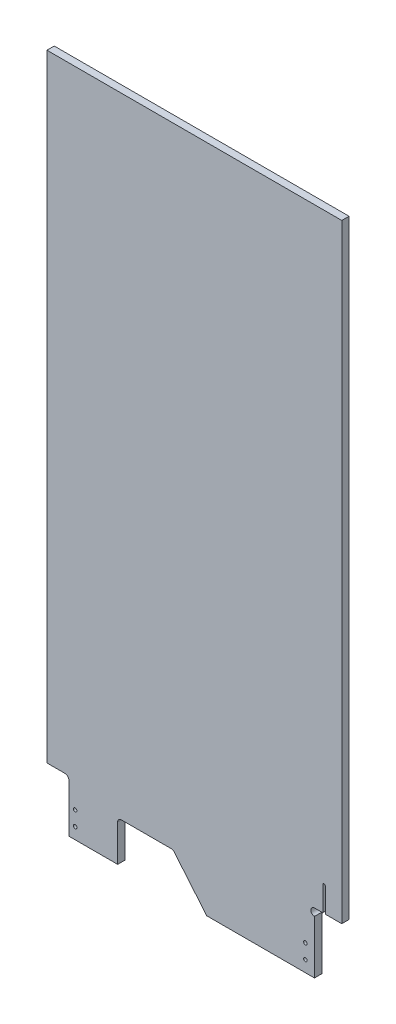
ISO-10303-21;
HEADER;
FILE_DESCRIPTION(('STEP AP214'),'2;1');
FILE_NAME('part.step','',(''),(''),'','','');
FILE_SCHEMA(('AUTOMOTIVE_DESIGN { 1 0 10303 214 1 1 1 1 }'));
ENDSEC;
DATA;
#1=APPLICATION_CONTEXT('core data for automotive mechanical design processes');
#2=APPLICATION_PROTOCOL_DEFINITION('international standard','automotive_design',2000,#1);
#3=PRODUCT_CONTEXT('',#1,'mechanical');
#4=PRODUCT('Part','Part','',(#3));
#5=PRODUCT_RELATED_PRODUCT_CATEGORY('part','',(#4));
#6=PRODUCT_DEFINITION_FORMATION('','',#4);
#7=PRODUCT_DEFINITION_CONTEXT('part definition',#1,'design');
#8=PRODUCT_DEFINITION('design','',#6,#7);
#9=PRODUCT_DEFINITION_SHAPE('','',#8);
#10=(LENGTH_UNIT() NAMED_UNIT(*) SI_UNIT(.MILLI.,.METRE.));
#11=(NAMED_UNIT(*) PLANE_ANGLE_UNIT() SI_UNIT($,.RADIAN.));
#12=(NAMED_UNIT(*) SI_UNIT($,.STERADIAN.) SOLID_ANGLE_UNIT());
#13=UNCERTAINTY_MEASURE_WITH_UNIT(LENGTH_MEASURE(1.E-05),#10,'distance_accuracy_value','');
#14=(GEOMETRIC_REPRESENTATION_CONTEXT(3) GLOBAL_UNCERTAINTY_ASSIGNED_CONTEXT((#13)) GLOBAL_UNIT_ASSIGNED_CONTEXT((#10,
#11,#12)) REPRESENTATION_CONTEXT('',''));
#15=CARTESIAN_POINT('',(0.,0.,0.));
#16=DIRECTION('',(0.,0.,1.));
#17=DIRECTION('',(1.,0.,0.));
#18=AXIS2_PLACEMENT_3D('',#15,#16,#17);
#19=CARTESIAN_POINT('',(10461.2027820586,13017.5001101928,-12.7));
#20=DIRECTION('',(0.,-1.,0.));
#21=DIRECTION('',(0.,0.,-1.));
#22=AXIS2_PLACEMENT_3D('',#19,#20,#21);
#23=PLANE('',#22);
#24=DIRECTION('',(1.,0.,0.));
#25=VECTOR('',#24,1.);
#26=CARTESIAN_POINT('',(10461.2027820586,13017.5001101928,0.));
#27=LINE('',#26,#25);
#28=CARTESIAN_POINT('',(10375.9021420887,13017.5001101928,0.));
#29=VERTEX_POINT('',#28);
#30=CARTESIAN_POINT('',(10461.2027820586,13017.5001101928,0.));
#31=VERTEX_POINT('',#30);
#32=EDGE_CURVE('E200',#29,#31,#27,.T.);
#33=ORIENTED_EDGE('',*,*,#32,.F.);
#34=DIRECTION('',(0.,0.,1.));
#35=VECTOR('',#34,1.);
#36=CARTESIAN_POINT('',(10375.9021420887,13017.5001101928,-12.7));
#37=LINE('',#36,#35);
#38=CARTESIAN_POINT('',(10375.9021420887,13017.5001101928,-12.7));
#39=VERTEX_POINT('',#38);
#40=EDGE_CURVE('E11',#39,#29,#37,.T.);
#41=ORIENTED_EDGE('',*,*,#40,.F.);
#42=DIRECTION('',(1.,0.,0.));
#43=VECTOR('',#42,1.);
#44=CARTESIAN_POINT('',(10461.2027820586,13017.5001101928,-12.7));
#45=LINE('',#44,#43);
#46=CARTESIAN_POINT('',(10461.2027820586,13017.5001101928,-12.7));
#47=VERTEX_POINT('',#46);
#48=EDGE_CURVE('E257',#39,#47,#45,.T.);
#49=ORIENTED_EDGE('',*,*,#48,.T.);
#50=DIRECTION('',(0.,0.,1.));
#51=VECTOR('',#50,1.);
#52=CARTESIAN_POINT('',(10461.2027820586,13017.5001101928,-12.7));
#53=LINE('',#52,#51);
#54=EDGE_CURVE('E34',#47,#31,#53,.T.);
#55=ORIENTED_EDGE('',*,*,#54,.T.);
#56=EDGE_LOOP('',(#33,#41,#49,#55));
#57=FACE_BOUND('',#56,.T.);
#58=ADVANCED_FACE('F31',(#57),#23,.T.);
#59=CARTESIAN_POINT('',(10375.9021420887,13017.5001101928,-12.7));
#60=DIRECTION('',(-1.,0.,0.));
#61=DIRECTION('',(0.,0.,1.));
#62=AXIS2_PLACEMENT_3D('',#59,#60,#61);
#63=PLANE('',#62);
#64=DIRECTION('',(0.,-1.,0.));
#65=VECTOR('',#64,1.);
#66=CARTESIAN_POINT('',(10375.9021420887,13017.5001101928,0.));
#67=LINE('',#66,#65);
#68=CARTESIAN_POINT('',(10375.9021420887,13102.653009206,0.));
#69=VERTEX_POINT('',#68);
#70=EDGE_CURVE('E255',#69,#29,#67,.T.);
#71=ORIENTED_EDGE('',*,*,#70,.F.);
#72=DIRECTION('',(0.,0.,1.));
#73=VECTOR('',#72,1.);
#74=CARTESIAN_POINT('',(10375.9021420887,13102.653009206,-12.7));
#75=LINE('',#74,#73);
#76=CARTESIAN_POINT('',(10375.9021420887,13102.653009206,-12.7));
#77=VERTEX_POINT('',#76);
#78=EDGE_CURVE('E40',#77,#69,#75,.T.);
#79=ORIENTED_EDGE('',*,*,#78,.F.);
#80=DIRECTION('',(0.,-1.,0.));
#81=VECTOR('',#80,1.);
#82=CARTESIAN_POINT('',(10375.9021420887,13017.5001101928,-12.7));
#83=LINE('',#82,#81);
#84=EDGE_CURVE('E190',#77,#39,#83,.T.);
#85=ORIENTED_EDGE('',*,*,#84,.T.);
#86=ORIENTED_EDGE('',*,*,#40,.T.);
#87=EDGE_LOOP('',(#71,#79,#85,#86));
#88=FACE_BOUND('',#87,.T.);
#89=ADVANCED_FACE('F293',(#88),#63,.T.);
#90=CARTESIAN_POINT('',(10369.5521420887,13102.653009206,-12.7));
#91=DIRECTION('',(0.,0.,1.));
#92=DIRECTION('',(1.,0.,0.));
#93=AXIS2_PLACEMENT_3D('',#90,#91,#92);
#94=CYLINDRICAL_SURFACE('',#93,6.34999999999941);
#95=CARTESIAN_POINT('',(10369.5521420887,13102.653009206,0.));
#96=DIRECTION('',(0.,0.,-1.));
#97=DIRECTION('',(1.,0.,0.));
#98=AXIS2_PLACEMENT_3D('',#95,#96,#97);
#99=CIRCLE('',#98,6.34999999999941);
#100=CARTESIAN_POINT('',(10369.5521420887,13109.003009206,0.));
#101=VERTEX_POINT('',#100);
#102=EDGE_CURVE('E177',#101,#69,#99,.T.);
#103=ORIENTED_EDGE('',*,*,#102,.F.);
#104=DIRECTION('',(0.,0.,1.));
#105=VECTOR('',#104,1.);
#106=CARTESIAN_POINT('',(10369.5521420887,13109.003009206,-12.7));
#107=LINE('',#106,#105);
#108=CARTESIAN_POINT('',(10369.5521420887,13109.003009206,-12.7));
#109=VERTEX_POINT('',#108);
#110=EDGE_CURVE('E172',#109,#101,#107,.T.);
#111=ORIENTED_EDGE('',*,*,#110,.F.);
#112=CARTESIAN_POINT('',(10369.5521420887,13102.653009206,-12.7));
#113=DIRECTION('',(0.,0.,-1.));
#114=DIRECTION('',(1.,0.,0.));
#115=AXIS2_PLACEMENT_3D('',#112,#113,#114);
#116=CIRCLE('',#115,6.34999999999941);
#117=EDGE_CURVE('E175',#109,#77,#116,.T.);
#118=ORIENTED_EDGE('',*,*,#117,.T.);
#119=ORIENTED_EDGE('',*,*,#78,.T.);
#120=EDGE_LOOP('',(#103,#111,#118,#119));
#121=FACE_BOUND('',#120,.T.);
#122=ADVANCED_FACE('F174',(#121),#94,.F.);
#123=CARTESIAN_POINT('',(10369.5521420887,13109.003009206,-12.7));
#124=DIRECTION('',(0.,-1.,0.));
#125=DIRECTION('',(0.,0.,-1.));
#126=AXIS2_PLACEMENT_3D('',#123,#124,#125);
#127=PLANE('',#126);
#128=DIRECTION('',(1.,0.,0.));
#129=VECTOR('',#128,1.);
#130=CARTESIAN_POINT('',(10369.5521420887,13109.003009206,0.));
#131=LINE('',#130,#129);
#132=CARTESIAN_POINT('',(10337.8021420887,13109.003009206,0.));
#133=VERTEX_POINT('',#132);
#134=EDGE_CURVE('E252',#133,#101,#131,.T.);
#135=ORIENTED_EDGE('',*,*,#134,.F.);
#136=DIRECTION('',(0.,0.,1.));
#137=VECTOR('',#136,1.);
#138=CARTESIAN_POINT('',(10337.8021420887,13109.003009206,-12.7));
#139=LINE('',#138,#137);
#140=CARTESIAN_POINT('',(10337.8021420887,13109.003009206,-12.7));
#141=VERTEX_POINT('',#140);
#142=EDGE_CURVE('E182',#141,#133,#139,.T.);
#143=ORIENTED_EDGE('',*,*,#142,.F.);
#144=DIRECTION('',(1.,0.,0.));
#145=VECTOR('',#144,1.);
#146=CARTESIAN_POINT('',(10369.5521420887,13109.003009206,-12.7));
#147=LINE('',#146,#145);
#148=EDGE_CURVE('E188',#141,#109,#147,.T.);
#149=ORIENTED_EDGE('',*,*,#148,.T.);
#150=ORIENTED_EDGE('',*,*,#110,.T.);
#151=EDGE_LOOP('',(#135,#143,#149,#150));
#152=FACE_BOUND('',#151,.T.);
#153=ADVANCED_FACE('F192',(#152),#127,.T.);
#154=CARTESIAN_POINT('',(10337.8021420887,13109.003009206,-12.7));
#155=DIRECTION('',(-0.999999999999162,-1.29471476797222E-06,0.));
#156=DIRECTION('',(1.29471476797222E-06,-0.999999999999162,0.));
#157=AXIS2_PLACEMENT_3D('',#154,#155,#156);
#158=PLANE('',#157);
#159=DIRECTION('',(1.29471476797222E-06,-0.999999999999162,0.));
#160=VECTOR('',#159,1.);
#161=CARTESIAN_POINT('',(10337.8021420887,13109.003009206,0.));
#162=LINE('',#161,#160);
#163=CARTESIAN_POINT('',(10337.8007478141,14185.9001101928,0.));
#164=VERTEX_POINT('',#163);
#165=EDGE_CURVE('E249',#164,#133,#162,.T.);
#166=ORIENTED_EDGE('',*,*,#165,.F.);
#167=DIRECTION('',(0.,0.,1.));
#168=VECTOR('',#167,1.);
#169=CARTESIAN_POINT('',(10337.8007478141,14185.9001101928,-12.7));
#170=LINE('',#169,#168);
#171=CARTESIAN_POINT('',(10337.8007478141,14185.9001101928,-12.7));
#172=VERTEX_POINT('',#171);
#173=EDGE_CURVE('E261',#172,#164,#170,.T.);
#174=ORIENTED_EDGE('',*,*,#173,.F.);
#175=DIRECTION('',(1.29471476797222E-06,-0.999999999999162,0.));
#176=VECTOR('',#175,1.);
#177=CARTESIAN_POINT('',(10337.8021420887,13109.003009206,-12.7));
#178=LINE('',#177,#176);
#179=EDGE_CURVE('E193',#172,#141,#178,.T.);
#180=ORIENTED_EDGE('',*,*,#179,.T.);
#181=ORIENTED_EDGE('',*,*,#142,.T.);
#182=EDGE_LOOP('',(#166,#174,#180,#181));
#183=FACE_BOUND('',#182,.T.);
#184=ADVANCED_FACE('F306',(#183),#158,.T.);
#185=CARTESIAN_POINT('',(10337.8007478141,14185.9001101928,-12.7));
#186=DIRECTION('',(0.,1.,0.));
#187=DIRECTION('',(0.,0.,1.));
#188=AXIS2_PLACEMENT_3D('',#185,#186,#187);
#189=PLANE('',#188);
#190=DIRECTION('',(-1.,0.,0.));
#191=VECTOR('',#190,1.);
#192=CARTESIAN_POINT('',(10337.8007478141,14185.9001101928,0.));
#193=LINE('',#192,#191);
#194=CARTESIAN_POINT('',(10852.1479242815,14185.9001101928,0.));
#195=VERTEX_POINT('',#194);
#196=EDGE_CURVE('E246',#195,#164,#193,.T.);
#197=ORIENTED_EDGE('',*,*,#196,.F.);
#198=DIRECTION('',(0.,0.,1.));
#199=VECTOR('',#198,1.);
#200=CARTESIAN_POINT('',(10852.1479242815,14185.9001101928,-12.7));
#201=LINE('',#200,#199);
#202=CARTESIAN_POINT('',(10852.1479242815,14185.9001101928,-12.7));
#203=VERTEX_POINT('',#202);
#204=EDGE_CURVE('E263',#203,#195,#201,.T.);
#205=ORIENTED_EDGE('',*,*,#204,.F.);
#206=DIRECTION('',(-1.,0.,0.));
#207=VECTOR('',#206,1.);
#208=CARTESIAN_POINT('',(10337.8007478141,14185.9001101928,-12.7));
#209=LINE('',#208,#207);
#210=EDGE_CURVE('E195',#203,#172,#209,.T.);
#211=ORIENTED_EDGE('',*,*,#210,.T.);
#212=ORIENTED_EDGE('',*,*,#173,.T.);
#213=EDGE_LOOP('',(#197,#205,#211,#212));
#214=FACE_BOUND('',#213,.T.);
#215=ADVANCED_FACE('F309',(#214),#189,.T.);
#216=CARTESIAN_POINT('',(10852.1479242815,14185.9001101928,-12.7));
#217=DIRECTION('',(0.99999999999647,2.65716833036978E-06,0.));
#218=DIRECTION('',(-2.65716833036978E-06,0.99999999999647,0.));
#219=AXIS2_PLACEMENT_3D('',#216,#217,#218);
#220=PLANE('',#219);
#221=DIRECTION('',(-2.65716833036978E-06,0.99999999999647,0.));
#222=VECTOR('',#221,1.);
#223=CARTESIAN_POINT('',(10852.1479242815,14185.9001101928,0.));
#224=LINE('',#223,#222);
#225=CARTESIAN_POINT('',(10852.1507478141,13123.290509206,0.));
#226=VERTEX_POINT('',#225);
#227=EDGE_CURVE('E243',#226,#195,#224,.T.);
#228=ORIENTED_EDGE('',*,*,#227,.F.);
#229=DIRECTION('',(0.,0.,1.));
#230=VECTOR('',#229,1.);
#231=CARTESIAN_POINT('',(10852.1507478141,13123.290509206,-12.7));
#232=LINE('',#231,#230);
#233=CARTESIAN_POINT('',(10852.1507478141,13123.290509206,-12.7));
#234=VERTEX_POINT('',#233);
#235=EDGE_CURVE('E265',#234,#226,#232,.T.);
#236=ORIENTED_EDGE('',*,*,#235,.F.);
#237=DIRECTION('',(-2.65716833036978E-06,0.99999999999647,0.));
#238=VECTOR('',#237,1.);
#239=CARTESIAN_POINT('',(10852.1479242815,14185.9001101928,-12.7));
#240=LINE('',#239,#238);
#241=EDGE_CURVE('E459',#234,#203,#240,.T.);
#242=ORIENTED_EDGE('',*,*,#241,.T.);
#243=ORIENTED_EDGE('',*,*,#204,.T.);
#244=EDGE_LOOP('',(#228,#236,#242,#243));
#245=FACE_BOUND('',#244,.T.);
#246=ADVANCED_FACE('F313',(#245),#220,.T.);
#247=CARTESIAN_POINT('',(10852.1507478141,13123.290509206,-12.7));
#248=DIRECTION('',(0.,-1.,0.));
#249=DIRECTION('',(0.,0.,-1.));
#250=AXIS2_PLACEMENT_3D('',#247,#248,#249);
#251=PLANE('',#250);
#252=DIRECTION('',(1.,0.,0.));
#253=VECTOR('',#252,1.);
#254=CARTESIAN_POINT('',(10852.1507478141,13123.290509206,0.));
#255=LINE('',#254,#253);
#256=CARTESIAN_POINT('',(10823.5812364163,13123.290509206,0.));
#257=VERTEX_POINT('',#256);
#258=EDGE_CURVE('E240',#257,#226,#255,.T.);
#259=ORIENTED_EDGE('',*,*,#258,.F.);
#260=DIRECTION('',(0.,0.,1.));
#261=VECTOR('',#260,1.);
#262=CARTESIAN_POINT('',(10823.5812364163,13123.290509206,-12.7));
#263=LINE('',#262,#261);
#264=CARTESIAN_POINT('',(10823.5812364163,13123.290509206,-12.7));
#265=VERTEX_POINT('',#264);
#266=EDGE_CURVE('E267',#265,#257,#263,.T.);
#267=ORIENTED_EDGE('',*,*,#266,.F.);
#268=DIRECTION('',(1.,0.,0.));
#269=VECTOR('',#268,1.);
#270=CARTESIAN_POINT('',(10852.1507478141,13123.290509206,-12.7));
#271=LINE('',#270,#269);
#272=EDGE_CURVE('E456',#265,#234,#271,.T.);
#273=ORIENTED_EDGE('',*,*,#272,.T.);
#274=ORIENTED_EDGE('',*,*,#235,.T.);
#275=EDGE_LOOP('',(#259,#267,#273,#274));
#276=FACE_BOUND('',#275,.T.);
#277=ADVANCED_FACE('F317',(#276),#251,.T.);
#278=CARTESIAN_POINT('',(10823.5812364163,13123.290509206,-12.7));
#279=DIRECTION('',(-1.,0.,0.));
#280=DIRECTION('',(0.,0.,1.));
#281=AXIS2_PLACEMENT_3D('',#278,#279,#280);
#282=PLANE('',#281);
#283=DIRECTION('',(0.,-1.,0.));
#284=VECTOR('',#283,1.);
#285=CARTESIAN_POINT('',(10823.5812364163,13123.290509206,0.));
#286=LINE('',#285,#284);
#287=CARTESIAN_POINT('',(10823.5812364163,13165.835509206,0.));
#288=VERTEX_POINT('',#287);
#289=EDGE_CURVE('E237',#288,#257,#286,.T.);
#290=ORIENTED_EDGE('',*,*,#289,.F.);
#291=DIRECTION('',(0.,0.,1.));
#292=VECTOR('',#291,1.);
#293=CARTESIAN_POINT('',(10823.5812364163,13165.835509206,-12.7));
#294=LINE('',#293,#292);
#295=CARTESIAN_POINT('',(10823.5812364163,13165.835509206,-12.7));
#296=VERTEX_POINT('',#295);
#297=EDGE_CURVE('E269',#296,#288,#294,.T.);
#298=ORIENTED_EDGE('',*,*,#297,.F.);
#299=DIRECTION('',(0.,-1.,0.));
#300=VECTOR('',#299,1.);
#301=CARTESIAN_POINT('',(10823.5812364163,13123.290509206,-12.7));
#302=LINE('',#301,#300);
#303=EDGE_CURVE('E453',#296,#265,#302,.T.);
#304=ORIENTED_EDGE('',*,*,#303,.T.);
#305=ORIENTED_EDGE('',*,*,#266,.T.);
#306=EDGE_LOOP('',(#290,#298,#304,#305));
#307=FACE_BOUND('',#306,.T.);
#308=ADVANCED_FACE('F321',(#307),#282,.T.);
#309=CARTESIAN_POINT('',(10821.2952364163,13165.835509206,-12.7));
#310=DIRECTION('',(0.,0.,1.));
#311=DIRECTION('',(1.,0.,0.));
#312=AXIS2_PLACEMENT_3D('',#309,#310,#311);
#313=CYLINDRICAL_SURFACE('',#312,2.28599999999979);
#314=CARTESIAN_POINT('',(10821.2952364163,13165.835509206,0.));
#315=DIRECTION('',(0.,0.,-1.));
#316=DIRECTION('',(1.,0.,0.));
#317=AXIS2_PLACEMENT_3D('',#314,#315,#316);
#318=CIRCLE('',#317,2.28599999999979);
#319=CARTESIAN_POINT('',(10819.0092364163,13165.835509206,0.));
#320=VERTEX_POINT('',#319);
#321=EDGE_CURVE('E234',#320,#288,#318,.T.);
#322=ORIENTED_EDGE('',*,*,#321,.F.);
#323=DIRECTION('',(0.,0.,1.));
#324=VECTOR('',#323,1.);
#325=CARTESIAN_POINT('',(10819.0092364163,13165.835509206,-12.7));
#326=LINE('',#325,#324);
#327=CARTESIAN_POINT('',(10819.0092364163,13165.835509206,-12.7));
#328=VERTEX_POINT('',#327);
#329=EDGE_CURVE('E271',#328,#320,#326,.T.);
#330=ORIENTED_EDGE('',*,*,#329,.F.);
#331=CARTESIAN_POINT('',(10821.2952364163,13165.835509206,-12.7));
#332=DIRECTION('',(0.,0.,-1.));
#333=DIRECTION('',(1.,0.,0.));
#334=AXIS2_PLACEMENT_3D('',#331,#332,#333);
#335=CIRCLE('',#334,2.28599999999979);
#336=EDGE_CURVE('E450',#328,#296,#335,.T.);
#337=ORIENTED_EDGE('',*,*,#336,.T.);
#338=ORIENTED_EDGE('',*,*,#297,.T.);
#339=EDGE_LOOP('',(#322,#330,#337,#338));
#340=FACE_BOUND('',#339,.T.);
#341=ADVANCED_FACE('F325',(#340),#313,.F.);
#342=CARTESIAN_POINT('',(10819.0092364163,13165.835509206,-12.7));
#343=DIRECTION('',(1.,0.,0.));
#344=DIRECTION('',(0.,0.,-1.));
#345=AXIS2_PLACEMENT_3D('',#342,#343,#344);
#346=PLANE('',#345);
#347=DIRECTION('',(0.,1.,0.));
#348=VECTOR('',#347,1.);
#349=CARTESIAN_POINT('',(10819.0092364163,13165.835509206,0.));
#350=LINE('',#349,#348);
#351=CARTESIAN_POINT('',(10819.0092364163,13123.290509206,0.));
#352=VERTEX_POINT('',#351);
#353=EDGE_CURVE('E231',#352,#320,#350,.T.);
#354=ORIENTED_EDGE('',*,*,#353,.F.);
#355=DIRECTION('',(0.,0.,1.));
#356=VECTOR('',#355,1.);
#357=CARTESIAN_POINT('',(10819.0092364163,13123.290509206,-12.7));
#358=LINE('',#357,#356);
#359=CARTESIAN_POINT('',(10819.0092364163,13123.290509206,-12.7));
#360=VERTEX_POINT('',#359);
#361=EDGE_CURVE('E273',#360,#352,#358,.T.);
#362=ORIENTED_EDGE('',*,*,#361,.F.);
#363=DIRECTION('',(0.,1.,0.));
#364=VECTOR('',#363,1.);
#365=CARTESIAN_POINT('',(10819.0092364163,13165.835509206,-12.7));
#366=LINE('',#365,#364);
#367=EDGE_CURVE('E447',#360,#328,#366,.T.);
#368=ORIENTED_EDGE('',*,*,#367,.T.);
#369=ORIENTED_EDGE('',*,*,#329,.T.);
#370=EDGE_LOOP('',(#354,#362,#368,#369));
#371=FACE_BOUND('',#370,.T.);
#372=ADVANCED_FACE('F329',(#371),#346,.T.);
#373=CARTESIAN_POINT('',(10819.0092364163,13123.290509206,-12.7));
#374=DIRECTION('',(0.,-1.,0.));
#375=DIRECTION('',(0.,0.,-1.));
#376=AXIS2_PLACEMENT_3D('',#373,#374,#375);
#377=PLANE('',#376);
#378=DIRECTION('',(1.,0.,0.));
#379=VECTOR('',#378,1.);
#380=CARTESIAN_POINT('',(10819.0092364163,13123.290509206,0.));
#381=LINE('',#380,#379);
#382=CARTESIAN_POINT('',(10804.5257478141,13123.290509206,0.));
#383=VERTEX_POINT('',#382);
#384=EDGE_CURVE('E228',#383,#352,#381,.T.);
#385=ORIENTED_EDGE('',*,*,#384,.F.);
#386=DIRECTION('',(0.,0.,1.));
#387=VECTOR('',#386,1.);
#388=CARTESIAN_POINT('',(10804.5257478141,13123.290509206,-12.7));
#389=LINE('',#388,#387);
#390=CARTESIAN_POINT('',(10804.5257478141,13123.290509206,-12.7));
#391=VERTEX_POINT('',#390);
#392=EDGE_CURVE('E275',#391,#383,#389,.T.);
#393=ORIENTED_EDGE('',*,*,#392,.F.);
#394=DIRECTION('',(1.,0.,0.));
#395=VECTOR('',#394,1.);
#396=CARTESIAN_POINT('',(10819.0092364163,13123.290509206,-12.7));
#397=LINE('',#396,#395);
#398=EDGE_CURVE('E444',#391,#360,#397,.T.);
#399=ORIENTED_EDGE('',*,*,#398,.T.);
#400=ORIENTED_EDGE('',*,*,#361,.T.);
#401=EDGE_LOOP('',(#385,#393,#399,#400));
#402=FACE_BOUND('',#401,.T.);
#403=ADVANCED_FACE('F333',(#402),#377,.T.);
#404=CARTESIAN_POINT('',(10804.5257478141,13116.940509206,-12.7));
#405=DIRECTION('',(0.,0.,1.));
#406=DIRECTION('',(1.,0.,0.));
#407=AXIS2_PLACEMENT_3D('',#404,#405,#406);
#408=CYLINDRICAL_SURFACE('',#407,6.34999999999941);
#409=CARTESIAN_POINT('',(10804.5257478141,13116.940509206,0.));
#410=DIRECTION('',(0.,0.,-1.));
#411=DIRECTION('',(1.,0.,0.));
#412=AXIS2_PLACEMENT_3D('',#409,#410,#411);
#413=CIRCLE('',#412,6.34999999999941);
#414=CARTESIAN_POINT('',(10804.5257478141,13110.590509206,0.));
#415=VERTEX_POINT('',#414);
#416=EDGE_CURVE('E225',#415,#383,#413,.T.);
#417=ORIENTED_EDGE('',*,*,#416,.F.);
#418=DIRECTION('',(0.,0.,1.));
#419=VECTOR('',#418,1.);
#420=CARTESIAN_POINT('',(10804.5257478141,13110.590509206,-12.7));
#421=LINE('',#420,#419);
#422=CARTESIAN_POINT('',(10804.5257478141,13110.590509206,-12.7));
#423=VERTEX_POINT('',#422);
#424=EDGE_CURVE('E277',#423,#415,#421,.T.);
#425=ORIENTED_EDGE('',*,*,#424,.F.);
#426=CARTESIAN_POINT('',(10804.5257478141,13116.940509206,-12.7));
#427=DIRECTION('',(0.,0.,-1.));
#428=DIRECTION('',(1.,0.,0.));
#429=AXIS2_PLACEMENT_3D('',#426,#427,#428);
#430=CIRCLE('',#429,6.34999999999941);
#431=EDGE_CURVE('E441',#423,#391,#430,.T.);
#432=ORIENTED_EDGE('',*,*,#431,.T.);
#433=ORIENTED_EDGE('',*,*,#392,.T.);
#434=EDGE_LOOP('',(#417,#425,#432,#433));
#435=FACE_BOUND('',#434,.T.);
#436=ADVANCED_FACE('F337',(#435),#408,.F.);
#437=CARTESIAN_POINT('',(10804.5257478141,13110.590509206,-12.7));
#438=DIRECTION('',(1.,0.,0.));
#439=DIRECTION('',(0.,0.,-1.));
#440=AXIS2_PLACEMENT_3D('',#437,#438,#439);
#441=PLANE('',#440);
#442=DIRECTION('',(0.,1.,0.));
#443=VECTOR('',#442,1.);
#444=CARTESIAN_POINT('',(10804.5257478141,13110.590509206,0.));
#445=LINE('',#444,#443);
#446=CARTESIAN_POINT('',(10804.5257478141,13017.5001101928,0.));
#447=VERTEX_POINT('',#446);
#448=EDGE_CURVE('E222',#447,#415,#445,.T.);
#449=ORIENTED_EDGE('',*,*,#448,.F.);
#450=DIRECTION('',(0.,0.,1.));
#451=VECTOR('',#450,1.);
#452=CARTESIAN_POINT('',(10804.5257478141,13017.5001101928,-12.7));
#453=LINE('',#452,#451);
#454=CARTESIAN_POINT('',(10804.5257478141,13017.5001101928,-12.7));
#455=VERTEX_POINT('',#454);
#456=EDGE_CURVE('E279',#455,#447,#453,.T.);
#457=ORIENTED_EDGE('',*,*,#456,.F.);
#458=DIRECTION('',(0.,1.,0.));
#459=VECTOR('',#458,1.);
#460=CARTESIAN_POINT('',(10804.5257478141,13110.590509206,-12.7));
#461=LINE('',#460,#459);
#462=EDGE_CURVE('E438',#455,#423,#461,.T.);
#463=ORIENTED_EDGE('',*,*,#462,.T.);
#464=ORIENTED_EDGE('',*,*,#424,.T.);
#465=EDGE_LOOP('',(#449,#457,#463,#464));
#466=FACE_BOUND('',#465,.T.);
#467=ADVANCED_FACE('F341',(#466),#441,.T.);
#468=CARTESIAN_POINT('',(10804.5257478141,13017.5001101928,-12.7));
#469=DIRECTION('',(0.,-1.,0.));
#470=DIRECTION('',(0.,0.,-1.));
#471=AXIS2_PLACEMENT_3D('',#468,#469,#470);
#472=PLANE('',#471);
#473=DIRECTION('',(1.,0.,0.));
#474=VECTOR('',#473,1.);
#475=CARTESIAN_POINT('',(10804.5257478141,13017.5001101928,0.));
#476=LINE('',#475,#474);
#477=CARTESIAN_POINT('',(10616.6252235168,13017.5001101928,0.));
#478=VERTEX_POINT('',#477);
#479=EDGE_CURVE('E219',#478,#447,#476,.T.);
#480=ORIENTED_EDGE('',*,*,#479,.F.);
#481=DIRECTION('',(0.,0.,1.));
#482=VECTOR('',#481,1.);
#483=CARTESIAN_POINT('',(10616.6252235168,13017.5001101928,-12.7));
#484=LINE('',#483,#482);
#485=CARTESIAN_POINT('',(10616.6252235168,13017.5001101928,-12.7));
#486=VERTEX_POINT('',#485);
#487=EDGE_CURVE('E281',#486,#478,#484,.T.);
#488=ORIENTED_EDGE('',*,*,#487,.F.);
#489=DIRECTION('',(1.,0.,0.));
#490=VECTOR('',#489,1.);
#491=CARTESIAN_POINT('',(10804.5257478141,13017.5001101928,-12.7));
#492=LINE('',#491,#490);
#493=EDGE_CURVE('E435',#486,#455,#492,.T.);
#494=ORIENTED_EDGE('',*,*,#493,.T.);
#495=ORIENTED_EDGE('',*,*,#456,.T.);
#496=EDGE_LOOP('',(#480,#488,#494,#495));
#497=FACE_BOUND('',#496,.T.);
#498=ADVANCED_FACE('F345',(#497),#472,.T.);
#499=CARTESIAN_POINT('',(10616.6252235168,13017.5001101928,-12.7));
#500=DIRECTION('',(-0.767281863842619,-0.641310019739437,0.));
#501=DIRECTION('',(0.641310019739437,-0.767281863842619,0.));
#502=AXIS2_PLACEMENT_3D('',#499,#500,#501);
#503=PLANE('',#502);
#504=DIRECTION('',(0.641310019739437,-0.767281863842619,0.));
#505=VECTOR('',#504,1.);
#506=CARTESIAN_POINT('',(10616.6252235168,13017.5001101928,0.));
#507=LINE('',#506,#505);
#508=CARTESIAN_POINT('',(10559.6498937161,13085.6670433405,0.));
#509=VERTEX_POINT('',#508);
#510=EDGE_CURVE('E216',#509,#478,#507,.T.);
#511=ORIENTED_EDGE('',*,*,#510,.F.);
#512=DIRECTION('',(0.,0.,1.));
#513=VECTOR('',#512,1.);
#514=CARTESIAN_POINT('',(10559.6498937161,13085.6670433405,-12.7));
#515=LINE('',#514,#513);
#516=CARTESIAN_POINT('',(10559.6498937161,13085.6670433405,-12.7));
#517=VERTEX_POINT('',#516);
#518=EDGE_CURVE('E283',#517,#509,#515,.T.);
#519=ORIENTED_EDGE('',*,*,#518,.F.);
#520=DIRECTION('',(0.641310019739437,-0.767281863842619,0.));
#521=VECTOR('',#520,1.);
#522=CARTESIAN_POINT('',(10616.6252235168,13017.5001101928,-12.7));
#523=LINE('',#522,#521);
#524=EDGE_CURVE('E432',#517,#486,#523,.T.);
#525=ORIENTED_EDGE('',*,*,#524,.T.);
#526=ORIENTED_EDGE('',*,*,#487,.T.);
#527=EDGE_LOOP('',(#511,#519,#525,#526));
#528=FACE_BOUND('',#527,.T.);
#529=ADVANCED_FACE('F349',(#528),#503,.T.);
#530=CARTESIAN_POINT('',(10554.7776538797,13081.5947247155,-12.7));
#531=DIRECTION('',(0.,0.,1.));
#532=DIRECTION('',(1.,0.,0.));
#533=AXIS2_PLACEMENT_3D('',#530,#531,#532);
#534=CYLINDRICAL_SURFACE('',#533,6.35000000055316);
#535=CARTESIAN_POINT('',(10554.7776538797,13081.5947247155,0.));
#536=DIRECTION('',(0.,0.,-1.));
#537=DIRECTION('',(1.,0.,0.));
#538=AXIS2_PLACEMENT_3D('',#535,#536,#537);
#539=CIRCLE('',#538,6.35000000055316);
#540=CARTESIAN_POINT('',(10554.7776538797,13087.9447247161,0.));
#541=VERTEX_POINT('',#540);
#542=EDGE_CURVE('E213',#541,#509,#539,.T.);
#543=ORIENTED_EDGE('',*,*,#542,.F.);
#544=DIRECTION('',(0.,0.,1.));
#545=VECTOR('',#544,1.);
#546=CARTESIAN_POINT('',(10554.7776538797,13087.9447247161,-12.7));
#547=LINE('',#546,#545);
#548=CARTESIAN_POINT('',(10554.7776538797,13087.9447247161,-12.7));
#549=VERTEX_POINT('',#548);
#550=EDGE_CURVE('E285',#549,#541,#547,.T.);
#551=ORIENTED_EDGE('',*,*,#550,.F.);
#552=CARTESIAN_POINT('',(10554.7776538797,13081.5947247155,-12.7));
#553=DIRECTION('',(0.,0.,-1.));
#554=DIRECTION('',(1.,0.,0.));
#555=AXIS2_PLACEMENT_3D('',#552,#553,#554);
#556=CIRCLE('',#555,6.35000000055316);
#557=EDGE_CURVE('E429',#549,#517,#556,.T.);
#558=ORIENTED_EDGE('',*,*,#557,.T.);
#559=ORIENTED_EDGE('',*,*,#518,.T.);
#560=EDGE_LOOP('',(#543,#551,#558,#559));
#561=FACE_BOUND('',#560,.T.);
#562=ADVANCED_FACE('F353',(#561),#534,.F.);
#563=CARTESIAN_POINT('',(10554.7776538797,13087.9447247161,-12.7));
#564=DIRECTION('',(0.,-1.,0.));
#565=DIRECTION('',(0.,0.,-1.));
#566=AXIS2_PLACEMENT_3D('',#563,#564,#565);
#567=PLANE('',#566);
#568=DIRECTION('',(1.,0.,0.));
#569=VECTOR('',#568,1.);
#570=CARTESIAN_POINT('',(10554.7776538797,13087.9447247161,0.));
#571=LINE('',#570,#569);
#572=CARTESIAN_POINT('',(10467.5527820586,13087.9447247161,0.));
#573=VERTEX_POINT('',#572);
#574=EDGE_CURVE('E210',#573,#541,#571,.T.);
#575=ORIENTED_EDGE('',*,*,#574,.F.);
#576=DIRECTION('',(0.,0.,1.));
#577=VECTOR('',#576,1.);
#578=CARTESIAN_POINT('',(10467.5527820586,13087.9447247161,-12.7));
#579=LINE('',#578,#577);
#580=CARTESIAN_POINT('',(10467.5527820586,13087.9447247161,-12.7));
#581=VERTEX_POINT('',#580);
#582=EDGE_CURVE('E287',#581,#573,#579,.T.);
#583=ORIENTED_EDGE('',*,*,#582,.F.);
#584=DIRECTION('',(1.,0.,0.));
#585=VECTOR('',#584,1.);
#586=CARTESIAN_POINT('',(10554.7776538797,13087.9447247161,-12.7));
#587=LINE('',#586,#585);
#588=EDGE_CURVE('E426',#581,#549,#587,.T.);
#589=ORIENTED_EDGE('',*,*,#588,.T.);
#590=ORIENTED_EDGE('',*,*,#550,.T.);
#591=EDGE_LOOP('',(#575,#583,#589,#590));
#592=FACE_BOUND('',#591,.T.);
#593=ADVANCED_FACE('F357',(#592),#567,.T.);
#594=CARTESIAN_POINT('',(10467.5527820586,13081.5947247161,-12.7));
#595=DIRECTION('',(0.,0.,1.));
#596=DIRECTION('',(1.,0.,0.));
#597=AXIS2_PLACEMENT_3D('',#594,#595,#596);
#598=CYLINDRICAL_SURFACE('',#597,6.35000000000119);
#599=CARTESIAN_POINT('',(10467.5527820586,13081.5947247161,0.));
#600=DIRECTION('',(0.,0.,-1.));
#601=DIRECTION('',(1.,0.,0.));
#602=AXIS2_PLACEMENT_3D('',#599,#600,#601);
#603=CIRCLE('',#602,6.35000000000119);
#604=CARTESIAN_POINT('',(10461.2027820586,13081.5947247161,0.));
#605=VERTEX_POINT('',#604);
#606=EDGE_CURVE('E207',#605,#573,#603,.T.);
#607=ORIENTED_EDGE('',*,*,#606,.F.);
#608=DIRECTION('',(0.,0.,1.));
#609=VECTOR('',#608,1.);
#610=CARTESIAN_POINT('',(10461.2027820586,13081.5947247161,-12.7));
#611=LINE('',#610,#609);
#612=CARTESIAN_POINT('',(10461.2027820586,13081.5947247161,-12.7));
#613=VERTEX_POINT('',#612);
#614=EDGE_CURVE('E288',#613,#605,#611,.T.);
#615=ORIENTED_EDGE('',*,*,#614,.F.);
#616=CARTESIAN_POINT('',(10467.5527820586,13081.5947247161,-12.7));
#617=DIRECTION('',(0.,0.,-1.));
#618=DIRECTION('',(1.,0.,0.));
#619=AXIS2_PLACEMENT_3D('',#616,#617,#618);
#620=CIRCLE('',#619,6.35000000000119);
#621=EDGE_CURVE('E423',#613,#581,#620,.T.);
#622=ORIENTED_EDGE('',*,*,#621,.T.);
#623=ORIENTED_EDGE('',*,*,#582,.T.);
#624=EDGE_LOOP('',(#607,#615,#622,#623));
#625=FACE_BOUND('',#624,.T.);
#626=ADVANCED_FACE('F361',(#625),#598,.F.);
#627=CARTESIAN_POINT('',(10461.2027820586,13081.5947247161,-12.7));
#628=DIRECTION('',(1.,0.,0.));
#629=DIRECTION('',(0.,0.,-1.));
#630=AXIS2_PLACEMENT_3D('',#627,#628,#629);
#631=PLANE('',#630);
#632=DIRECTION('',(0.,1.,0.));
#633=VECTOR('',#632,1.);
#634=CARTESIAN_POINT('',(10461.2027820586,13081.5947247161,0.));
#635=LINE('',#634,#633);
#636=EDGE_CURVE('E203',#31,#605,#635,.T.);
#637=ORIENTED_EDGE('',*,*,#636,.F.);
#638=ORIENTED_EDGE('',*,*,#54,.F.);
#639=DIRECTION('',(0.,1.,0.));
#640=VECTOR('',#639,1.);
#641=CARTESIAN_POINT('',(10461.2027820586,13081.5947247161,-12.7));
#642=LINE('',#641,#640);
#643=EDGE_CURVE('E421',#47,#613,#642,.T.);
#644=ORIENTED_EDGE('',*,*,#643,.T.);
#645=ORIENTED_EDGE('',*,*,#614,.T.);
#646=EDGE_LOOP('',(#637,#638,#644,#645));
#647=FACE_BOUND('',#646,.T.);
#648=ADVANCED_FACE('F290',(#647),#631,.T.);
#649=CARTESIAN_POINT('',(10369.5521420887,13102.653009206,-12.7));
#650=DIRECTION('',(0.,0.,1.));
#651=DIRECTION('',(1.,0.,0.));
#652=AXIS2_PLACEMENT_3D('',#649,#650,#651);
#653=PLANE('',#652);
#654=CARTESIAN_POINT('',(10788.6500506781,13037.3121101928,-12.7));
#655=DIRECTION('',(0.,0.,1.));
#656=DIRECTION('',(1.,0.,0.));
#657=AXIS2_PLACEMENT_3D('',#654,#655,#656);
#658=CIRCLE('',#657,3.11149999999886);
#659=CARTESIAN_POINT('',(10791.7615506781,13037.3121101928,-12.7));
#660=VERTEX_POINT('',#659);
#661=EDGE_CURVE('E396',#660,#660,#658,.F.);
#662=ORIENTED_EDGE('',*,*,#661,.F.);
#663=EDGE_LOOP('',(#662));
#664=FACE_BOUND('',#663,.T.);
#665=CARTESIAN_POINT('',(10788.6500506781,13062.7121101928,-12.7));
#666=DIRECTION('',(0.,0.,1.));
#667=DIRECTION('',(1.,0.,0.));
#668=AXIS2_PLACEMENT_3D('',#665,#666,#667);
#669=CIRCLE('',#668,3.11149999999886);
#670=CARTESIAN_POINT('',(10791.7615506781,13062.7121101928,-12.7));
#671=VERTEX_POINT('',#670);
#672=EDGE_CURVE('E406',#671,#671,#669,.F.);
#673=ORIENTED_EDGE('',*,*,#672,.F.);
#674=EDGE_LOOP('',(#673));
#675=FACE_BOUND('',#674,.T.);
#676=CARTESIAN_POINT('',(10387.0125506781,13037.3121101928,-12.7));
#677=DIRECTION('',(0.,0.,1.));
#678=DIRECTION('',(1.,0.,0.));
#679=AXIS2_PLACEMENT_3D('',#676,#677,#678);
#680=CIRCLE('',#679,3.11149999999886);
#681=CARTESIAN_POINT('',(10390.1240506781,13037.3121101928,-12.7));
#682=VERTEX_POINT('',#681);
#683=EDGE_CURVE('E412',#682,#682,#680,.F.);
#684=ORIENTED_EDGE('',*,*,#683,.F.);
#685=EDGE_LOOP('',(#684));
#686=FACE_BOUND('',#685,.T.);
#687=CARTESIAN_POINT('',(10387.0125506781,13062.7121101928,-12.7));
#688=DIRECTION('',(0.,0.,1.));
#689=DIRECTION('',(1.,0.,0.));
#690=AXIS2_PLACEMENT_3D('',#687,#688,#689);
#691=CIRCLE('',#690,3.11149999999938);
#692=CARTESIAN_POINT('',(10390.1240506781,13062.7121101928,-12.7));
#693=VERTEX_POINT('',#692);
#694=EDGE_CURVE('E204',#693,#693,#691,.F.);
#695=ORIENTED_EDGE('',*,*,#694,.F.);
#696=EDGE_LOOP('',(#695));
#697=FACE_BOUND('',#696,.T.);
#698=ORIENTED_EDGE('',*,*,#48,.F.);
#699=ORIENTED_EDGE('',*,*,#84,.F.);
#700=ORIENTED_EDGE('',*,*,#117,.F.);
#701=ORIENTED_EDGE('',*,*,#148,.F.);
#702=ORIENTED_EDGE('',*,*,#179,.F.);
#703=ORIENTED_EDGE('',*,*,#210,.F.);
#704=ORIENTED_EDGE('',*,*,#241,.F.);
#705=ORIENTED_EDGE('',*,*,#272,.F.);
#706=ORIENTED_EDGE('',*,*,#303,.F.);
#707=ORIENTED_EDGE('',*,*,#336,.F.);
#708=ORIENTED_EDGE('',*,*,#367,.F.);
#709=ORIENTED_EDGE('',*,*,#398,.F.);
#710=ORIENTED_EDGE('',*,*,#431,.F.);
#711=ORIENTED_EDGE('',*,*,#462,.F.);
#712=ORIENTED_EDGE('',*,*,#493,.F.);
#713=ORIENTED_EDGE('',*,*,#524,.F.);
#714=ORIENTED_EDGE('',*,*,#557,.F.);
#715=ORIENTED_EDGE('',*,*,#588,.F.);
#716=ORIENTED_EDGE('',*,*,#621,.F.);
#717=ORIENTED_EDGE('',*,*,#643,.F.);
#718=EDGE_LOOP('',(#698,#699,#700,#701,#702,#703,#704,#705,#706,#707,#708,#709,#710,#711,#712,
#713,#714,#715,#716,#717));
#719=FACE_BOUND('',#718,.T.);
#720=ADVANCED_FACE('F186',(#664,#675,#686,#697,#719),#653,.F.);
#721=CARTESIAN_POINT('',(10369.5521420887,13102.653009206,0.));
#722=DIRECTION('',(0.,0.,1.));
#723=DIRECTION('',(1.,0.,0.));
#724=AXIS2_PLACEMENT_3D('',#721,#722,#723);
#725=PLANE('',#724);
#726=CARTESIAN_POINT('',(10788.6500506781,13037.3121101928,0.));
#727=DIRECTION('',(0.,0.,1.));
#728=DIRECTION('',(1.,0.,0.));
#729=AXIS2_PLACEMENT_3D('',#726,#727,#728);
#730=CIRCLE('',#729,3.11149999999886);
#731=CARTESIAN_POINT('',(10791.7615506781,13037.3121101928,0.));
#732=VERTEX_POINT('',#731);
#733=EDGE_CURVE('E399',#732,#732,#730,.T.);
#734=ORIENTED_EDGE('',*,*,#733,.F.);
#735=EDGE_LOOP('',(#734));
#736=FACE_BOUND('',#735,.T.);
#737=CARTESIAN_POINT('',(10788.6500506781,13062.7121101928,0.));
#738=DIRECTION('',(0.,0.,1.));
#739=DIRECTION('',(1.,0.,0.));
#740=AXIS2_PLACEMENT_3D('',#737,#738,#739);
#741=CIRCLE('',#740,3.11149999999886);
#742=CARTESIAN_POINT('',(10791.7615506781,13062.7121101928,0.));
#743=VERTEX_POINT('',#742);
#744=EDGE_CURVE('E401',#743,#743,#741,.T.);
#745=ORIENTED_EDGE('',*,*,#744,.F.);
#746=EDGE_LOOP('',(#745));
#747=FACE_BOUND('',#746,.T.);
#748=CARTESIAN_POINT('',(10387.0125506781,13037.3121101928,0.));
#749=DIRECTION('',(0.,0.,1.));
#750=DIRECTION('',(1.,0.,0.));
#751=AXIS2_PLACEMENT_3D('',#748,#749,#750);
#752=CIRCLE('',#751,3.11149999999886);
#753=CARTESIAN_POINT('',(10390.1240506781,13037.3121101928,0.));
#754=VERTEX_POINT('',#753);
#755=EDGE_CURVE('E409',#754,#754,#752,.T.);
#756=ORIENTED_EDGE('',*,*,#755,.F.);
#757=EDGE_LOOP('',(#756));
#758=FACE_BOUND('',#757,.T.);
#759=CARTESIAN_POINT('',(10387.0125506781,13062.7121101928,0.));
#760=DIRECTION('',(0.,0.,1.));
#761=DIRECTION('',(1.,0.,0.));
#762=AXIS2_PLACEMENT_3D('',#759,#760,#761);
#763=CIRCLE('',#762,3.11149999999938);
#764=CARTESIAN_POINT('',(10390.1240506781,13062.7121101928,0.));
#765=VERTEX_POINT('',#764);
#766=EDGE_CURVE('E415',#765,#765,#763,.T.);
#767=ORIENTED_EDGE('',*,*,#766,.F.);
#768=EDGE_LOOP('',(#767));
#769=FACE_BOUND('',#768,.T.);
#770=ORIENTED_EDGE('',*,*,#32,.T.);
#771=ORIENTED_EDGE('',*,*,#636,.T.);
#772=ORIENTED_EDGE('',*,*,#606,.T.);
#773=ORIENTED_EDGE('',*,*,#574,.T.);
#774=ORIENTED_EDGE('',*,*,#542,.T.);
#775=ORIENTED_EDGE('',*,*,#510,.T.);
#776=ORIENTED_EDGE('',*,*,#479,.T.);
#777=ORIENTED_EDGE('',*,*,#448,.T.);
#778=ORIENTED_EDGE('',*,*,#416,.T.);
#779=ORIENTED_EDGE('',*,*,#384,.T.);
#780=ORIENTED_EDGE('',*,*,#353,.T.);
#781=ORIENTED_EDGE('',*,*,#321,.T.);
#782=ORIENTED_EDGE('',*,*,#289,.T.);
#783=ORIENTED_EDGE('',*,*,#258,.T.);
#784=ORIENTED_EDGE('',*,*,#227,.T.);
#785=ORIENTED_EDGE('',*,*,#196,.T.);
#786=ORIENTED_EDGE('',*,*,#165,.T.);
#787=ORIENTED_EDGE('',*,*,#134,.T.);
#788=ORIENTED_EDGE('',*,*,#102,.T.);
#789=ORIENTED_EDGE('',*,*,#70,.T.);
#790=EDGE_LOOP('',(#770,#771,#772,#773,#774,#775,#776,#777,#778,#779,#780,#781,#782,#783,#784,
#785,#786,#787,#788,#789));
#791=FACE_BOUND('',#790,.T.);
#792=ADVANCED_FACE('F292',(#736,#747,#758,#769,#791),#725,.T.);
#793=CARTESIAN_POINT('',(10387.0125506781,13062.7121101928,-21.5006509986457));
#794=DIRECTION('',(0.,0.,1.));
#795=DIRECTION('',(1.,0.,0.));
#796=AXIS2_PLACEMENT_3D('',#793,#794,#795);
#797=CYLINDRICAL_SURFACE('',#796,3.11149999999938);
#798=ORIENTED_EDGE('',*,*,#694,.T.);
#799=EDGE_LOOP('',(#798));
#800=FACE_BOUND('',#799,.T.);
#801=ORIENTED_EDGE('',*,*,#766,.T.);
#802=EDGE_LOOP('',(#801));
#803=FACE_BOUND('',#802,.T.);
#804=ADVANCED_FACE('F373',(#800,#803),#797,.F.);
#805=CARTESIAN_POINT('',(10387.0125506781,13037.3121101928,-21.5006509986457));
#806=DIRECTION('',(0.,0.,1.));
#807=DIRECTION('',(1.,0.,0.));
#808=AXIS2_PLACEMENT_3D('',#805,#806,#807);
#809=CYLINDRICAL_SURFACE('',#808,3.11149999999886);
#810=ORIENTED_EDGE('',*,*,#683,.T.);
#811=EDGE_LOOP('',(#810));
#812=FACE_BOUND('',#811,.T.);
#813=ORIENTED_EDGE('',*,*,#755,.T.);
#814=EDGE_LOOP('',(#813));
#815=FACE_BOUND('',#814,.T.);
#816=ADVANCED_FACE('F380',(#812,#815),#809,.F.);
#817=CARTESIAN_POINT('',(10788.6500506781,13062.7121101928,-21.5006509986457));
#818=DIRECTION('',(0.,0.,1.));
#819=DIRECTION('',(1.,0.,0.));
#820=AXIS2_PLACEMENT_3D('',#817,#818,#819);
#821=CYLINDRICAL_SURFACE('',#820,3.11149999999886);
#822=ORIENTED_EDGE('',*,*,#672,.T.);
#823=EDGE_LOOP('',(#822));
#824=FACE_BOUND('',#823,.T.);
#825=ORIENTED_EDGE('',*,*,#744,.T.);
#826=EDGE_LOOP('',(#825));
#827=FACE_BOUND('',#826,.T.);
#828=ADVANCED_FACE('F384',(#824,#827),#821,.F.);
#829=CARTESIAN_POINT('',(10788.6500506781,13037.3121101928,-21.5006509986457));
#830=DIRECTION('',(0.,0.,1.));
#831=DIRECTION('',(1.,0.,0.));
#832=AXIS2_PLACEMENT_3D('',#829,#830,#831);
#833=CYLINDRICAL_SURFACE('',#832,3.11149999999886);
#834=ORIENTED_EDGE('',*,*,#661,.T.);
#835=EDGE_LOOP('',(#834));
#836=FACE_BOUND('',#835,.T.);
#837=ORIENTED_EDGE('',*,*,#733,.T.);
#838=EDGE_LOOP('',(#837));
#839=FACE_BOUND('',#838,.T.);
#840=ADVANCED_FACE('F388',(#836,#839),#833,.F.);
#841=CLOSED_SHELL('',(#58,#89,#122,#153,#184,#215,#246,#277,#308,#341,#372,#403,#436,#467,#498,
#529,#562,#593,#626,#648,#720,#792,#804,#816,#828,#840));
#842=MANIFOLD_SOLID_BREP('B2',#841);
#843=ADVANCED_BREP_SHAPE_REPRESENTATION('',(#18,#842),#14);
#844=SHAPE_DEFINITION_REPRESENTATION(#9,#843);
ENDSEC;
END-ISO-10303-21;
